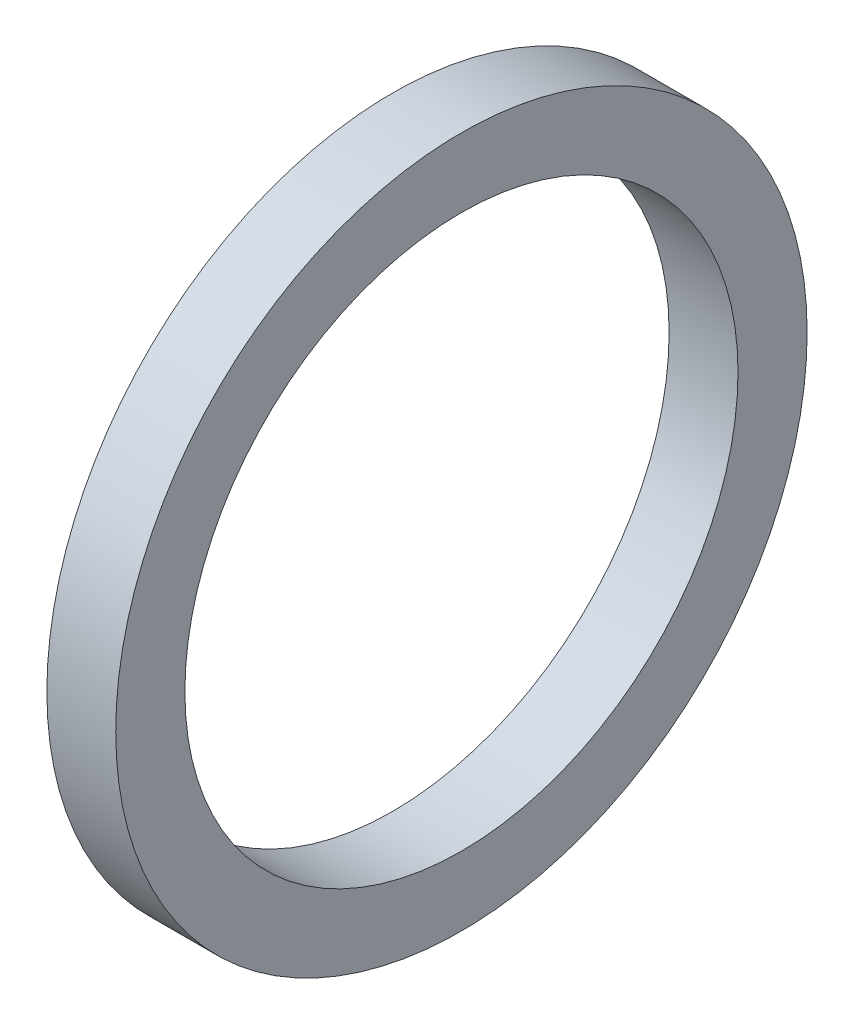
ISO-10303-21;
HEADER;
FILE_DESCRIPTION(('STEP AP214'),'2;1');
FILE_NAME('part.step','',(''),(''),'','','');
FILE_SCHEMA(('AUTOMOTIVE_DESIGN { 1 0 10303 214 1 1 1 1 }'));
ENDSEC;
DATA;
#1=APPLICATION_CONTEXT('core data for automotive mechanical design processes');
#2=APPLICATION_PROTOCOL_DEFINITION('international standard','automotive_design',2000,#1);
#3=PRODUCT_CONTEXT('',#1,'mechanical');
#4=PRODUCT('Part','Part','',(#3));
#5=PRODUCT_RELATED_PRODUCT_CATEGORY('part','',(#4));
#6=PRODUCT_DEFINITION_FORMATION('','',#4);
#7=PRODUCT_DEFINITION_CONTEXT('part definition',#1,'design');
#8=PRODUCT_DEFINITION('design','',#6,#7);
#9=PRODUCT_DEFINITION_SHAPE('','',#8);
#10=(LENGTH_UNIT() NAMED_UNIT(*) SI_UNIT(.MILLI.,.METRE.));
#11=(NAMED_UNIT(*) PLANE_ANGLE_UNIT() SI_UNIT($,.RADIAN.));
#12=(NAMED_UNIT(*) SI_UNIT($,.STERADIAN.) SOLID_ANGLE_UNIT());
#13=UNCERTAINTY_MEASURE_WITH_UNIT(LENGTH_MEASURE(1.E-05),#10,'distance_accuracy_value','');
#14=(GEOMETRIC_REPRESENTATION_CONTEXT(3) GLOBAL_UNCERTAINTY_ASSIGNED_CONTEXT((#13)) GLOBAL_UNIT_ASSIGNED_CONTEXT((#10,
#11,#12)) REPRESENTATION_CONTEXT('',''));
#15=CARTESIAN_POINT('',(0.,0.,0.));
#16=DIRECTION('',(0.,0.,1.));
#17=DIRECTION('',(1.,0.,0.));
#18=AXIS2_PLACEMENT_3D('',#15,#16,#17);
#19=CARTESIAN_POINT('',(19.611549931,40.00000001,0.));
#20=DIRECTION('',(-1.,0.,0.));
#21=DIRECTION('',(0.,0.,1.));
#22=AXIS2_PLACEMENT_3D('',#19,#20,#21);
#23=PLANE('',#22);
#24=CARTESIAN_POINT('',(19.611549931,0.,0.));
#25=DIRECTION('',(-1.,0.,0.));
#26=DIRECTION('',(0.,0.,1.));
#27=AXIS2_PLACEMENT_3D('',#24,#25,#26);
#28=CIRCLE('',#27,49.999999949);
#29=CARTESIAN_POINT('',(19.611549931,0.,49.999999949));
#30=VERTEX_POINT('',#29);
#31=EDGE_CURVE('E49',#30,#30,#28,.T.);
#32=ORIENTED_EDGE('',*,*,#31,.F.);
#33=EDGE_LOOP('',(#32));
#34=FACE_BOUND('',#33,.T.);
#35=CARTESIAN_POINT('',(19.611549931,0.,0.));
#36=DIRECTION('',(-1.,0.,0.));
#37=DIRECTION('',(0.,0.,1.));
#38=AXIS2_PLACEMENT_3D('',#35,#36,#37);
#39=CIRCLE('',#38,40.00000001);
#40=CARTESIAN_POINT('',(19.611549931,0.,40.00000001));
#41=VERTEX_POINT('',#40);
#42=EDGE_CURVE('E10',#41,#41,#39,.T.);
#43=ORIENTED_EDGE('',*,*,#42,.T.);
#44=EDGE_LOOP('',(#43));
#45=FACE_BOUND('',#44,.T.);
#46=ADVANCED_FACE('F35',(#34,#45),#23,.F.);
#47=CARTESIAN_POINT('',(0.,0.,0.));
#48=DIRECTION('',(-1.,0.,0.));
#49=DIRECTION('',(0.,0.,1.));
#50=AXIS2_PLACEMENT_3D('',#47,#48,#49);
#51=CYLINDRICAL_SURFACE('',#50,40.00000001);
#52=ORIENTED_EDGE('',*,*,#42,.F.);
#53=EDGE_LOOP('',(#52));
#54=FACE_BOUND('',#53,.T.);
#55=CARTESIAN_POINT('',(9.65155003899999,0.,0.));
#56=DIRECTION('',(-1.,0.,0.));
#57=DIRECTION('',(0.,0.,1.));
#58=AXIS2_PLACEMENT_3D('',#55,#56,#57);
#59=CIRCLE('',#58,40.00000001);
#60=CARTESIAN_POINT('',(9.65155003899999,0.,40.00000001));
#61=VERTEX_POINT('',#60);
#62=EDGE_CURVE('E41',#61,#61,#59,.T.);
#63=ORIENTED_EDGE('',*,*,#62,.T.);
#64=EDGE_LOOP('',(#63));
#65=FACE_BOUND('',#64,.T.);
#66=ADVANCED_FACE('F58',(#54,#65),#51,.F.);
#67=CARTESIAN_POINT('',(9.65155003899999,40.00000001,0.));
#68=DIRECTION('',(1.,0.,0.));
#69=DIRECTION('',(0.,0.,-1.));
#70=AXIS2_PLACEMENT_3D('',#67,#68,#69);
#71=PLANE('',#70);
#72=ORIENTED_EDGE('',*,*,#62,.F.);
#73=EDGE_LOOP('',(#72));
#74=FACE_BOUND('',#73,.T.);
#75=CARTESIAN_POINT('',(9.65155003899999,0.,0.));
#76=DIRECTION('',(-1.,0.,0.));
#77=DIRECTION('',(0.,0.,1.));
#78=AXIS2_PLACEMENT_3D('',#75,#76,#77);
#79=CIRCLE('',#78,49.999999949);
#80=CARTESIAN_POINT('',(9.65155003899999,0.,49.999999949));
#81=VERTEX_POINT('',#80);
#82=EDGE_CURVE('E45',#81,#81,#79,.T.);
#83=ORIENTED_EDGE('',*,*,#82,.T.);
#84=EDGE_LOOP('',(#83));
#85=FACE_BOUND('',#84,.T.);
#86=ADVANCED_FACE('F62',(#74,#85),#71,.F.);
#87=CARTESIAN_POINT('',(0.,0.,0.));
#88=DIRECTION('',(-1.,0.,0.));
#89=DIRECTION('',(0.,0.,1.));
#90=AXIS2_PLACEMENT_3D('',#87,#88,#89);
#91=CYLINDRICAL_SURFACE('',#90,49.999999949);
#92=ORIENTED_EDGE('',*,*,#82,.F.);
#93=EDGE_LOOP('',(#92));
#94=FACE_BOUND('',#93,.T.);
#95=ORIENTED_EDGE('',*,*,#31,.T.);
#96=EDGE_LOOP('',(#95));
#97=FACE_BOUND('',#96,.T.);
#98=ADVANCED_FACE('F55',(#94,#97),#91,.T.);
#99=CLOSED_SHELL('',(#46,#66,#86,#98));
#100=MANIFOLD_SOLID_BREP('B2',#99);
#101=ADVANCED_BREP_SHAPE_REPRESENTATION('',(#18,#100),#14);
#102=SHAPE_DEFINITION_REPRESENTATION(#9,#101);
ENDSEC;
END-ISO-10303-21;
